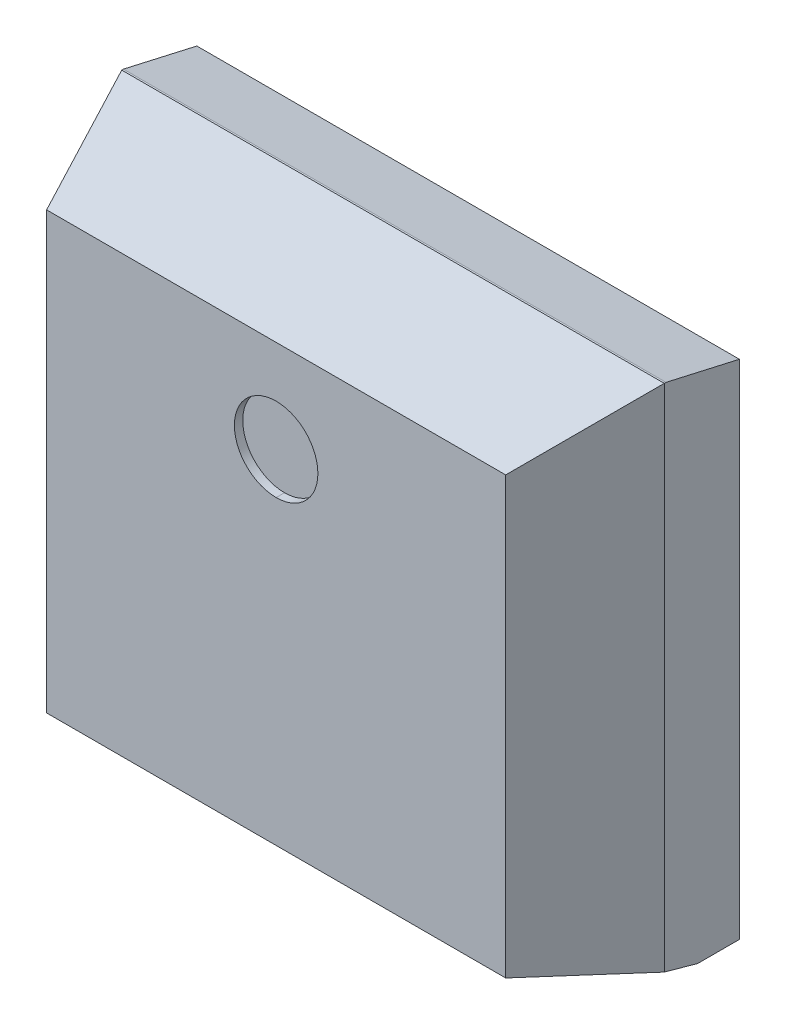
ISO-10303-21;
HEADER;
FILE_DESCRIPTION(('STEP AP214'),'2;1');
FILE_NAME('part.step','',(''),(''),'','','');
FILE_SCHEMA(('AUTOMOTIVE_DESIGN { 1 0 10303 214 1 1 1 1 }'));
ENDSEC;
DATA;
#1=APPLICATION_CONTEXT('core data for automotive mechanical design processes');
#2=APPLICATION_PROTOCOL_DEFINITION('international standard','automotive_design',2000,#1);
#3=PRODUCT_CONTEXT('',#1,'mechanical');
#4=PRODUCT('Part','Part','',(#3));
#5=PRODUCT_RELATED_PRODUCT_CATEGORY('part','',(#4));
#6=PRODUCT_DEFINITION_FORMATION('','',#4);
#7=PRODUCT_DEFINITION_CONTEXT('part definition',#1,'design');
#8=PRODUCT_DEFINITION('design','',#6,#7);
#9=PRODUCT_DEFINITION_SHAPE('','',#8);
#10=(LENGTH_UNIT() NAMED_UNIT(*) SI_UNIT(.MILLI.,.METRE.));
#11=(NAMED_UNIT(*) PLANE_ANGLE_UNIT() SI_UNIT($,.RADIAN.));
#12=(NAMED_UNIT(*) SI_UNIT($,.STERADIAN.) SOLID_ANGLE_UNIT());
#13=UNCERTAINTY_MEASURE_WITH_UNIT(LENGTH_MEASURE(1.E-05),#10,'distance_accuracy_value','');
#14=(GEOMETRIC_REPRESENTATION_CONTEXT(3) GLOBAL_UNCERTAINTY_ASSIGNED_CONTEXT((#13)) GLOBAL_UNIT_ASSIGNED_CONTEXT((#10,
#11,#12)) REPRESENTATION_CONTEXT('',''));
#15=CARTESIAN_POINT('',(0.,0.,0.));
#16=DIRECTION('',(0.,0.,1.));
#17=DIRECTION('',(1.,0.,0.));
#18=AXIS2_PLACEMENT_3D('',#15,#16,#17);
#19=CARTESIAN_POINT('',(133.844744279938,99.1670432923501,144.531582908599));
#20=DIRECTION('',(0.,0.,-1.));
#21=DIRECTION('',(0.,1.,0.));
#22=AXIS2_PLACEMENT_3D('',#19,#20,#21);
#23=CYLINDRICAL_SURFACE('',#22,0.5);
#24=CARTESIAN_POINT('',(133.844744279938,99.1670432923501,144.531582908599));
#25=DIRECTION('',(0.,0.,-1.));
#26=DIRECTION('',(0.,1.,0.));
#27=AXIS2_PLACEMENT_3D('',#24,#25,#26);
#28=CIRCLE('',#27,0.5);
#29=CARTESIAN_POINT('',(133.844744279938,98.6670432923501,144.531582908599));
#30=VERTEX_POINT('',#29);
#31=CARTESIAN_POINT('',(133.844744279938,99.6670432923501,144.531582908599));
#32=VERTEX_POINT('',#31);
#33=EDGE_CURVE('E67',#30,#32,#28,.T.);
#34=ORIENTED_EDGE('',*,*,#33,.F.);
#35=DIRECTION('',(0.,0.,-1.));
#36=VECTOR('',#35,1.);
#37=CARTESIAN_POINT('',(133.844744279938,98.6670432923501,144.531582908599));
#38=LINE('',#37,#36);
#39=CARTESIAN_POINT('',(133.844744279938,98.6670432923501,144.431582908599));
#40=VERTEX_POINT('',#39);
#41=EDGE_CURVE('E11',#30,#40,#38,.T.);
#42=ORIENTED_EDGE('',*,*,#41,.T.);
#43=CARTESIAN_POINT('',(133.844744279938,99.1670432923501,144.431582908599));
#44=DIRECTION('',(0.,0.,-1.));
#45=DIRECTION('',(0.,1.,0.));
#46=AXIS2_PLACEMENT_3D('',#43,#44,#45);
#47=CIRCLE('',#46,0.5);
#48=CARTESIAN_POINT('',(133.844744279938,99.6670432923501,144.431582908599));
#49=VERTEX_POINT('',#48);
#50=EDGE_CURVE('E55',#40,#49,#47,.T.);
#51=ORIENTED_EDGE('',*,*,#50,.T.);
#52=DIRECTION('',(0.,0.,-1.));
#53=VECTOR('',#52,1.);
#54=CARTESIAN_POINT('',(133.844744279938,99.6670432923501,144.531582908599));
#55=LINE('',#54,#53);
#56=EDGE_CURVE('E48',#32,#49,#55,.T.);
#57=ORIENTED_EDGE('',*,*,#56,.F.);
#58=EDGE_LOOP('',(#34,#42,#51,#57));
#59=FACE_BOUND('',#58,.T.);
#60=ADVANCED_FACE('F44',(#59),#23,.F.);
#61=CARTESIAN_POINT('',(133.844744279938,99.1670432923501,144.431582908599));
#62=DIRECTION('',(0.,0.,-1.));
#63=DIRECTION('',(-1.,0.,0.));
#64=AXIS2_PLACEMENT_3D('',#61,#62,#63);
#65=PLANE('',#64);
#66=CARTESIAN_POINT('',(133.844744279938,99.1670432923501,144.431582908599));
#67=DIRECTION('',(0.,0.,-1.));
#68=DIRECTION('',(0.,1.,0.));
#69=AXIS2_PLACEMENT_3D('',#66,#67,#68);
#70=CIRCLE('',#69,0.5);
#71=EDGE_CURVE('E209',#49,#40,#70,.T.);
#72=ORIENTED_EDGE('',*,*,#71,.F.);
#73=ORIENTED_EDGE('',*,*,#50,.F.);
#74=EDGE_LOOP('',(#72,#73));
#75=FACE_BOUND('',#74,.T.);
#76=ADVANCED_FACE('F297',(#75),#65,.F.);
#77=CARTESIAN_POINT('',(133.844744279938,99.1670432923501,144.531582908599));
#78=DIRECTION('',(0.,0.,-1.));
#79=DIRECTION('',(0.,1.,0.));
#80=AXIS2_PLACEMENT_3D('',#77,#78,#79);
#81=CYLINDRICAL_SURFACE('',#80,0.5);
#82=ORIENTED_EDGE('',*,*,#41,.F.);
#83=CARTESIAN_POINT('',(133.844744279938,99.1670432923501,144.531582908599));
#84=DIRECTION('',(0.,0.,-1.));
#85=DIRECTION('',(0.,1.,0.));
#86=AXIS2_PLACEMENT_3D('',#83,#84,#85);
#87=CIRCLE('',#86,0.5);
#88=EDGE_CURVE('E213',#32,#30,#87,.T.);
#89=ORIENTED_EDGE('',*,*,#88,.F.);
#90=ORIENTED_EDGE('',*,*,#56,.T.);
#91=ORIENTED_EDGE('',*,*,#71,.T.);
#92=EDGE_LOOP('',(#82,#89,#90,#91));
#93=FACE_BOUND('',#92,.T.);
#94=ADVANCED_FACE('F302',(#93),#81,.F.);
#95=CARTESIAN_POINT('',(130.844744279938,100.27704329235,143.831582908599));
#96=DIRECTION('',(0.941741911594905,0.,-0.336336396997966));
#97=DIRECTION('',(0.,-1.,0.));
#98=AXIS2_PLACEMENT_3D('',#95,#96,#97);
#99=PLANE('',#98);
#100=DIRECTION('',(0.,-1.,0.));
#101=VECTOR('',#100,1.);
#102=CARTESIAN_POINT('',(130.594744279938,100.27704329235,143.131582908599));
#103=LINE('',#102,#101);
#104=CARTESIAN_POINT('',(130.594744279938,100.77704329235,143.131582908599));
#105=VERTEX_POINT('',#104);
#106=CARTESIAN_POINT('',(130.594744279938,94.6681544034611,143.131582908599));
#107=VERTEX_POINT('',#106);
#108=EDGE_CURVE('E197',#105,#107,#103,.T.);
#109=ORIENTED_EDGE('',*,*,#108,.T.);
#110=DIRECTION('',(-0.325387179985109,-0.253078917766085,-0.911084103957305));
#111=VECTOR('',#110,1.);
#112=CARTESIAN_POINT('',(131.022512762632,95.0008632233341,144.329334660141));
#113=LINE('',#112,#111);
#114=CARTESIAN_POINT('',(131.094744279938,95.0570432923501,144.531582908599));
#115=VERTEX_POINT('',#114);
#116=EDGE_CURVE('E228',#115,#107,#113,.T.);
#117=ORIENTED_EDGE('',*,*,#116,.F.);
#118=DIRECTION('',(0.,-1.,0.));
#119=VECTOR('',#118,1.);
#120=CARTESIAN_POINT('',(131.094744279938,100.27704329235,144.531582908599));
#121=LINE('',#120,#119);
#122=CARTESIAN_POINT('',(131.094744279938,100.27704329235,144.531582908599));
#123=VERTEX_POINT('',#122);
#124=EDGE_CURVE('E202',#123,#115,#121,.T.);
#125=ORIENTED_EDGE('',*,*,#124,.F.);
#126=DIRECTION('',(-0.31878835653184,0.31878835653184,-0.892607398288552));
#127=VECTOR('',#126,1.);
#128=CARTESIAN_POINT('',(131.175028832784,100.196758739504,144.756379656566));
#129=LINE('',#128,#127);
#130=EDGE_CURVE('E194',#123,#105,#129,.T.);
#131=ORIENTED_EDGE('',*,*,#130,.T.);
#132=EDGE_LOOP('',(#109,#117,#125,#131));
#133=FACE_BOUND('',#132,.T.);
#134=ADVANCED_FACE('F281',(#133),#99,.F.);
#135=CARTESIAN_POINT('',(133.844744279938,97.6670432923501,144.531582908599));
#136=DIRECTION('',(0.,0.,1.));
#137=DIRECTION('',(1.,0.,0.));
#138=AXIS2_PLACEMENT_3D('',#135,#136,#137);
#139=PLANE('',#138);
#140=DIRECTION('',(-1.,0.,0.));
#141=VECTOR('',#140,1.);
#142=CARTESIAN_POINT('',(137.094744279938,100.27704329235,144.531582908599));
#143=LINE('',#142,#141);
#144=CARTESIAN_POINT('',(136.594744279938,100.27704329235,144.531582908599));
#145=VERTEX_POINT('',#144);
#146=EDGE_CURVE('E198',#145,#123,#143,.T.);
#147=ORIENTED_EDGE('',*,*,#146,.T.);
#148=ORIENTED_EDGE('',*,*,#124,.T.);
#149=DIRECTION('',(1.,0.,0.));
#150=VECTOR('',#149,1.);
#151=CARTESIAN_POINT('',(130.594744279938,95.0570432923501,144.531582908599));
#152=LINE('',#151,#150);
#153=CARTESIAN_POINT('',(136.594744279938,95.0570432923501,144.531582908599));
#154=VERTEX_POINT('',#153);
#155=EDGE_CURVE('E212',#115,#154,#152,.T.);
#156=ORIENTED_EDGE('',*,*,#155,.T.);
#157=DIRECTION('',(0.,1.,0.));
#158=VECTOR('',#157,1.);
#159=CARTESIAN_POINT('',(136.594744279938,95.0570432923501,144.531582908599));
#160=LINE('',#159,#158);
#161=EDGE_CURVE('E210',#154,#145,#160,.T.);
#162=ORIENTED_EDGE('',*,*,#161,.T.);
#163=EDGE_LOOP('',(#147,#148,#156,#162));
#164=FACE_BOUND('',#163,.T.);
#165=ORIENTED_EDGE('',*,*,#88,.T.);
#166=ORIENTED_EDGE('',*,*,#33,.T.);
#167=EDGE_LOOP('',(#165,#166));
#168=FACE_BOUND('',#167,.T.);
#169=ADVANCED_FACE('F293',(#164,#168),#139,.T.);
#170=CARTESIAN_POINT('',(130.594744279938,94.5570432923501,142.231582908599));
#171=DIRECTION('',(0.,1.,0.));
#172=DIRECTION('',(1.,0.,0.));
#173=AXIS2_PLACEMENT_3D('',#170,#171,#172);
#174=PLANE('',#173);
#175=DIRECTION('',(1.,0.,0.));
#176=VECTOR('',#175,1.);
#177=CARTESIAN_POINT('',(130.594744279938,94.5570432923501,142.231582908599));
#178=LINE('',#177,#176);
#179=CARTESIAN_POINT('',(130.594744279938,94.5570432923501,142.231582908599));
#180=VERTEX_POINT('',#179);
#181=CARTESIAN_POINT('',(137.094744279938,94.5570432923501,142.231582908599));
#182=VERTEX_POINT('',#181);
#183=EDGE_CURVE('E227',#180,#182,#178,.T.);
#184=ORIENTED_EDGE('',*,*,#183,.T.);
#185=DIRECTION('',(0.,0.,1.));
#186=VECTOR('',#185,1.);
#187=CARTESIAN_POINT('',(137.094744279938,94.5570432923501,142.231582908599));
#188=LINE('',#187,#186);
#189=CARTESIAN_POINT('',(137.094744279938,94.5570432923501,142.731582908599));
#190=VERTEX_POINT('',#189);
#191=EDGE_CURVE('E167',#182,#190,#188,.T.);
#192=ORIENTED_EDGE('',*,*,#191,.T.);
#193=DIRECTION('',(1.,0.,0.));
#194=VECTOR('',#193,1.);
#195=CARTESIAN_POINT('',(130.594744279938,94.5570432923501,142.731582908599));
#196=LINE('',#195,#194);
#197=CARTESIAN_POINT('',(130.594744279938,94.5570432923501,142.731582908599));
#198=VERTEX_POINT('',#197);
#199=EDGE_CURVE('E98',#198,#190,#196,.T.);
#200=ORIENTED_EDGE('',*,*,#199,.F.);
#201=DIRECTION('',(0.,0.,1.));
#202=VECTOR('',#201,1.);
#203=CARTESIAN_POINT('',(130.594744279938,94.5570432923501,142.231582908599));
#204=LINE('',#203,#202);
#205=EDGE_CURVE('E115',#180,#198,#204,.T.);
#206=ORIENTED_EDGE('',*,*,#205,.F.);
#207=EDGE_LOOP('',(#184,#192,#200,#206));
#208=FACE_BOUND('',#207,.T.);
#209=ADVANCED_FACE('F285',(#208),#174,.F.);
#210=CARTESIAN_POINT('',(130.594744279938,94.8070432923501,143.631582908599));
#211=DIRECTION('',(0.,0.963517909629969,-0.267643863785991));
#212=DIRECTION('',(-1.,0.,0.));
#213=AXIS2_PLACEMENT_3D('',#210,#211,#212);
#214=PLANE('',#213);
#215=ORIENTED_EDGE('',*,*,#155,.F.);
#216=ORIENTED_EDGE('',*,*,#116,.T.);
#217=DIRECTION('',(0.,0.267643863785991,0.963517909629969));
#218=VECTOR('',#217,1.);
#219=CARTESIAN_POINT('',(130.594744279938,94.8403527479371,143.751496948714));
#220=LINE('',#219,#218);
#221=EDGE_CURVE('E224',#198,#107,#220,.T.);
#222=ORIENTED_EDGE('',*,*,#221,.F.);
#223=ORIENTED_EDGE('',*,*,#199,.T.);
#224=DIRECTION('',(0.,0.267643863785991,0.963517909629969));
#225=VECTOR('',#224,1.);
#226=CARTESIAN_POINT('',(137.094744279938,94.6175733783101,142.949491218055));
#227=LINE('',#226,#225);
#228=CARTESIAN_POINT('',(137.094744279938,94.6681544034611,143.131582908599));
#229=VERTEX_POINT('',#228);
#230=EDGE_CURVE('E241',#190,#229,#227,.T.);
#231=ORIENTED_EDGE('',*,*,#230,.T.);
#232=DIRECTION('',(0.325387179985109,-0.253078917766085,-0.911084103957305));
#233=VECTOR('',#232,1.);
#234=CARTESIAN_POINT('',(136.537806080628,95.1013285584801,144.691009866667));
#235=LINE('',#234,#233);
#236=EDGE_CURVE('E152',#154,#229,#235,.T.);
#237=ORIENTED_EDGE('',*,*,#236,.F.);
#238=EDGE_LOOP('',(#215,#216,#222,#223,#231,#237));
#239=FACE_BOUND('',#238,.T.);
#240=ADVANCED_FACE('F283',(#239),#214,.F.);
#241=CARTESIAN_POINT('',(133.844744279938,97.6670432923501,142.231582908599));
#242=DIRECTION('',(0.,0.,1.));
#243=DIRECTION('',(1.,0.,0.));
#244=AXIS2_PLACEMENT_3D('',#241,#242,#243);
#245=PLANE('',#244);
#246=DIRECTION('',(-1.,0.,0.));
#247=VECTOR('',#246,1.);
#248=CARTESIAN_POINT('',(137.094744279938,100.57704329235,142.231582908599));
#249=LINE('',#248,#247);
#250=CARTESIAN_POINT('',(137.094744279938,100.57704329235,142.231582908599));
#251=VERTEX_POINT('',#250);
#252=CARTESIAN_POINT('',(130.594744279938,100.57704329235,142.231582908599));
#253=VERTEX_POINT('',#252);
#254=EDGE_CURVE('E175',#251,#253,#249,.T.);
#255=ORIENTED_EDGE('',*,*,#254,.F.);
#256=DIRECTION('',(0.,1.,0.));
#257=VECTOR('',#256,1.);
#258=CARTESIAN_POINT('',(137.094744279938,94.5570432923501,142.231582908599));
#259=LINE('',#258,#257);
#260=EDGE_CURVE('E158',#182,#251,#259,.T.);
#261=ORIENTED_EDGE('',*,*,#260,.F.);
#262=ORIENTED_EDGE('',*,*,#183,.F.);
#263=DIRECTION('',(0.,-1.,0.));
#264=VECTOR('',#263,1.);
#265=CARTESIAN_POINT('',(130.594744279938,100.77704329235,142.231582908599));
#266=LINE('',#265,#264);
#267=EDGE_CURVE('E177',#253,#180,#266,.T.);
#268=ORIENTED_EDGE('',*,*,#267,.F.);
#269=EDGE_LOOP('',(#255,#261,#262,#268));
#270=FACE_BOUND('',#269,.T.);
#271=ADVANCED_FACE('F176',(#270),#245,.F.);
#272=CARTESIAN_POINT('',(136.844744279938,95.0570432923501,143.831582908599));
#273=DIRECTION('',(-0.941741911594905,0.,-0.336336396997966));
#274=DIRECTION('',(-0.336336396997966,0.,0.941741911594905));
#275=AXIS2_PLACEMENT_3D('',#272,#273,#274);
#276=PLANE('',#275);
#277=DIRECTION('',(0.,1.,0.));
#278=VECTOR('',#277,1.);
#279=CARTESIAN_POINT('',(137.094744279938,95.0570432923501,143.131582908599));
#280=LINE('',#279,#278);
#281=CARTESIAN_POINT('',(137.094744279938,100.77704329235,143.131582908599));
#282=VERTEX_POINT('',#281);
#283=EDGE_CURVE('E258',#229,#282,#280,.T.);
#284=ORIENTED_EDGE('',*,*,#283,.T.);
#285=DIRECTION('',(0.31878835653184,0.31878835653184,-0.892607398288552));
#286=VECTOR('',#285,1.);
#287=CARTESIAN_POINT('',(136.579500377499,100.261799389911,144.574265835428));
#288=LINE('',#287,#286);
#289=EDGE_CURVE('E220',#145,#282,#288,.T.);
#290=ORIENTED_EDGE('',*,*,#289,.F.);
#291=ORIENTED_EDGE('',*,*,#161,.F.);
#292=ORIENTED_EDGE('',*,*,#236,.T.);
#293=EDGE_LOOP('',(#284,#290,#291,#292));
#294=FACE_BOUND('',#293,.T.);
#295=ADVANCED_FACE('F291',(#294),#276,.F.);
#296=CARTESIAN_POINT('',(130.594744279938,100.77704329235,142.231582908599));
#297=DIRECTION('',(1.,0.,0.));
#298=DIRECTION('',(0.,1.,0.));
#299=AXIS2_PLACEMENT_3D('',#296,#297,#298);
#300=PLANE('',#299);
#301=DIRECTION('',(0.,-0.221621103589098,-0.97513285579143));
#302=VECTOR('',#301,1.);
#303=CARTESIAN_POINT('',(130.594744279938,100.631954883706,142.473193910564));
#304=LINE('',#303,#302);
#305=CARTESIAN_POINT('',(130.594744279938,100.77704329235,143.111582908599));
#306=VERTEX_POINT('',#305);
#307=EDGE_CURVE('E205',#306,#253,#304,.T.);
#308=ORIENTED_EDGE('',*,*,#307,.T.);
#309=ORIENTED_EDGE('',*,*,#267,.T.);
#310=ORIENTED_EDGE('',*,*,#205,.T.);
#311=ORIENTED_EDGE('',*,*,#221,.T.);
#312=ORIENTED_EDGE('',*,*,#108,.F.);
#313=DIRECTION('',(0.,0.,1.));
#314=VECTOR('',#313,1.);
#315=CARTESIAN_POINT('',(130.594744279938,100.77704329235,142.231582908599));
#316=LINE('',#315,#314);
#317=EDGE_CURVE('E253',#306,#105,#316,.T.);
#318=ORIENTED_EDGE('',*,*,#317,.F.);
#319=EDGE_LOOP('',(#308,#309,#310,#311,#312,#318));
#320=FACE_BOUND('',#319,.T.);
#321=ADVANCED_FACE('F282',(#320),#300,.F.);
#322=CARTESIAN_POINT('',(137.094744279938,100.52704329235,143.831582908599));
#323=DIRECTION('',(0.,-0.941741911594905,-0.336336396997966));
#324=DIRECTION('',(0.,0.336336396997966,-0.941741911594905));
#325=AXIS2_PLACEMENT_3D('',#322,#323,#324);
#326=PLANE('',#325);
#327=ORIENTED_EDGE('',*,*,#289,.T.);
#328=DIRECTION('',(-1.,0.,0.));
#329=VECTOR('',#328,1.);
#330=CARTESIAN_POINT('',(137.094744279938,100.77704329235,143.131582908599));
#331=LINE('',#330,#329);
#332=EDGE_CURVE('E182',#282,#105,#331,.T.);
#333=ORIENTED_EDGE('',*,*,#332,.T.);
#334=ORIENTED_EDGE('',*,*,#130,.F.);
#335=ORIENTED_EDGE('',*,*,#146,.F.);
#336=EDGE_LOOP('',(#327,#333,#334,#335));
#337=FACE_BOUND('',#336,.T.);
#338=ADVANCED_FACE('F274',(#337),#326,.F.);
#339=CARTESIAN_POINT('',(137.094744279938,100.67704329235,142.671582908599));
#340=DIRECTION('',(0.,0.97513285579143,-0.221621103589098));
#341=DIRECTION('',(-1.,0.,0.));
#342=AXIS2_PLACEMENT_3D('',#339,#340,#341);
#343=PLANE('',#342);
#344=ORIENTED_EDGE('',*,*,#254,.T.);
#345=ORIENTED_EDGE('',*,*,#307,.F.);
#346=DIRECTION('',(-1.,0.,0.));
#347=VECTOR('',#346,1.);
#348=CARTESIAN_POINT('',(137.094744279938,100.77704329235,143.111582908599));
#349=LINE('',#348,#347);
#350=CARTESIAN_POINT('',(137.094744279938,100.77704329235,143.111582908599));
#351=VERTEX_POINT('',#350);
#352=EDGE_CURVE('E185',#351,#306,#349,.T.);
#353=ORIENTED_EDGE('',*,*,#352,.F.);
#354=DIRECTION('',(0.,-0.221621103589098,-0.97513285579143));
#355=VECTOR('',#354,1.);
#356=CARTESIAN_POINT('',(137.094744279938,100.479204392546,141.801091749463));
#357=LINE('',#356,#355);
#358=EDGE_CURVE('E164',#351,#251,#357,.T.);
#359=ORIENTED_EDGE('',*,*,#358,.T.);
#360=EDGE_LOOP('',(#344,#345,#353,#359));
#361=FACE_BOUND('',#360,.T.);
#362=ADVANCED_FACE('F46',(#361),#343,.T.);
#363=CARTESIAN_POINT('',(137.094744279938,94.5570432923501,142.231582908599));
#364=DIRECTION('',(-1.,0.,0.));
#365=DIRECTION('',(0.,0.,1.));
#366=AXIS2_PLACEMENT_3D('',#363,#364,#365);
#367=PLANE('',#366);
#368=ORIENTED_EDGE('',*,*,#283,.F.);
#369=ORIENTED_EDGE('',*,*,#230,.F.);
#370=ORIENTED_EDGE('',*,*,#191,.F.);
#371=ORIENTED_EDGE('',*,*,#260,.T.);
#372=ORIENTED_EDGE('',*,*,#358,.F.);
#373=DIRECTION('',(0.,0.,1.));
#374=VECTOR('',#373,1.);
#375=CARTESIAN_POINT('',(137.094744279938,100.77704329235,142.231582908599));
#376=LINE('',#375,#374);
#377=EDGE_CURVE('E172',#351,#282,#376,.T.);
#378=ORIENTED_EDGE('',*,*,#377,.T.);
#379=EDGE_LOOP('',(#368,#369,#370,#371,#372,#378));
#380=FACE_BOUND('',#379,.T.);
#381=ADVANCED_FACE('F161',(#380),#367,.F.);
#382=CARTESIAN_POINT('',(137.094744279938,100.77704329235,142.231582908599));
#383=DIRECTION('',(0.,-1.,0.));
#384=DIRECTION('',(0.,0.,-1.));
#385=AXIS2_PLACEMENT_3D('',#382,#383,#384);
#386=PLANE('',#385);
#387=ORIENTED_EDGE('',*,*,#352,.T.);
#388=ORIENTED_EDGE('',*,*,#317,.T.);
#389=ORIENTED_EDGE('',*,*,#332,.F.);
#390=ORIENTED_EDGE('',*,*,#377,.F.);
#391=EDGE_LOOP('',(#387,#388,#389,#390));
#392=FACE_BOUND('',#391,.T.);
#393=ADVANCED_FACE('F278',(#392),#386,.F.);
#394=CLOSED_SHELL('',(#60,#76,#94,#134,#169,#209,#240,#271,#295,#321,#338,#362,#381,#393));
#395=MANIFOLD_SOLID_BREP('B2',#394);
#396=ADVANCED_BREP_SHAPE_REPRESENTATION('',(#18,#395),#14);
#397=SHAPE_DEFINITION_REPRESENTATION(#9,#396);
ENDSEC;
END-ISO-10303-21;
